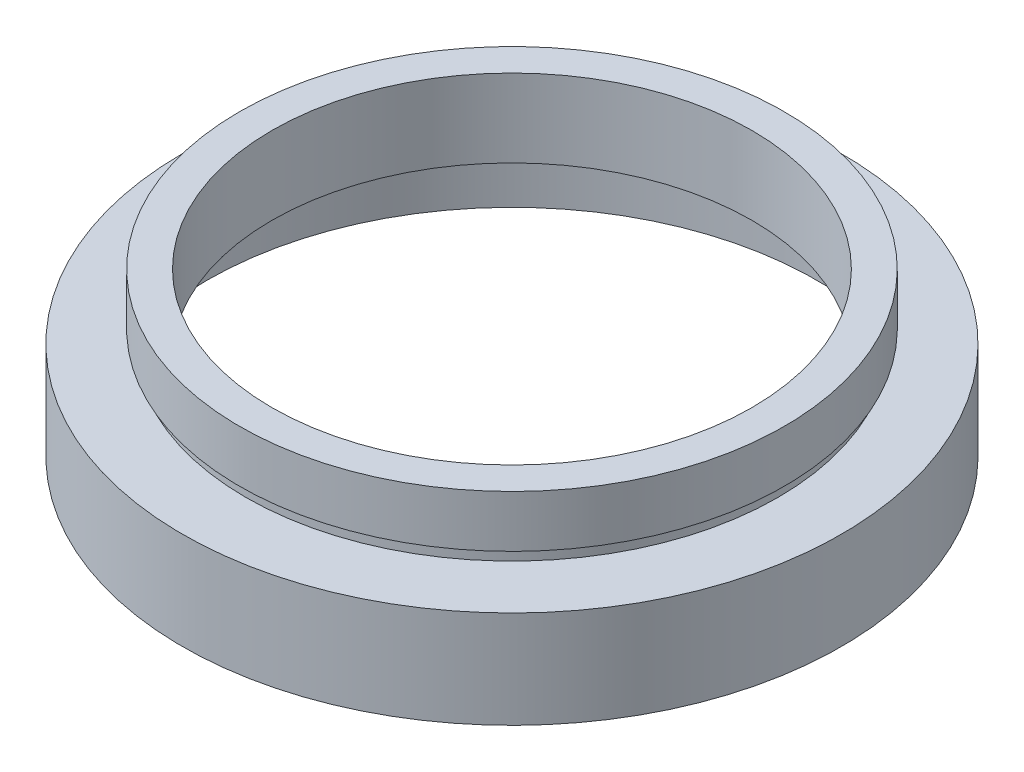
ISO-10303-21;
HEADER;
FILE_DESCRIPTION(('STEP AP214'),'2;1');
FILE_NAME('part.step','',(''),(''),'','','');
FILE_SCHEMA(('AUTOMOTIVE_DESIGN { 1 0 10303 214 1 1 1 1 }'));
ENDSEC;
DATA;
#1=APPLICATION_CONTEXT('core data for automotive mechanical design processes');
#2=APPLICATION_PROTOCOL_DEFINITION('international standard','automotive_design',2000,#1);
#3=PRODUCT_CONTEXT('',#1,'mechanical');
#4=PRODUCT('Part','Part','',(#3));
#5=PRODUCT_RELATED_PRODUCT_CATEGORY('part','',(#4));
#6=PRODUCT_DEFINITION_FORMATION('','',#4);
#7=PRODUCT_DEFINITION_CONTEXT('part definition',#1,'design');
#8=PRODUCT_DEFINITION('design','',#6,#7);
#9=PRODUCT_DEFINITION_SHAPE('','',#8);
#10=(LENGTH_UNIT() NAMED_UNIT(*) SI_UNIT(.MILLI.,.METRE.));
#11=(NAMED_UNIT(*) PLANE_ANGLE_UNIT() SI_UNIT($,.RADIAN.));
#12=(NAMED_UNIT(*) SI_UNIT($,.STERADIAN.) SOLID_ANGLE_UNIT());
#13=UNCERTAINTY_MEASURE_WITH_UNIT(LENGTH_MEASURE(1.E-05),#10,'distance_accuracy_value','');
#14=(GEOMETRIC_REPRESENTATION_CONTEXT(3) GLOBAL_UNCERTAINTY_ASSIGNED_CONTEXT((#13)) GLOBAL_UNIT_ASSIGNED_CONTEXT((#10,
#11,#12)) REPRESENTATION_CONTEXT('',''));
#15=CARTESIAN_POINT('',(0.,0.,0.));
#16=DIRECTION('',(0.,0.,1.));
#17=DIRECTION('',(1.,0.,0.));
#18=AXIS2_PLACEMENT_3D('',#15,#16,#17);
#19=CARTESIAN_POINT('',(25.4,0.,0.));
#20=DIRECTION('',(0.,1.,0.));
#21=DIRECTION('',(-1.,0.,0.));
#22=AXIS2_PLACEMENT_3D('',#19,#20,#21);
#23=PLANE('',#22);
#24=CARTESIAN_POINT('',(0.,0.,0.));
#25=DIRECTION('',(0.,1.,0.));
#26=DIRECTION('',(-1.,0.,0.));
#27=AXIS2_PLACEMENT_3D('',#24,#25,#26);
#28=CIRCLE('',#27,25.4);
#29=CARTESIAN_POINT('',(-25.4,0.,0.));
#30=VERTEX_POINT('',#29);
#31=EDGE_CURVE('E77',#30,#30,#28,.T.);
#32=ORIENTED_EDGE('',*,*,#31,.F.);
#33=EDGE_LOOP('',(#32));
#34=FACE_BOUND('',#33,.T.);
#35=CARTESIAN_POINT('',(0.,0.,0.));
#36=DIRECTION('',(0.,1.,0.));
#37=DIRECTION('',(-1.,0.,0.));
#38=AXIS2_PLACEMENT_3D('',#35,#36,#37);
#39=CIRCLE('',#38,23.5);
#40=CARTESIAN_POINT('',(-23.5,0.,0.));
#41=VERTEX_POINT('',#40);
#42=EDGE_CURVE('E10',#41,#41,#39,.T.);
#43=ORIENTED_EDGE('',*,*,#42,.T.);
#44=EDGE_LOOP('',(#43));
#45=FACE_BOUND('',#44,.T.);
#46=ADVANCED_FACE('F37',(#34,#45),#23,.F.);
#47=CARTESIAN_POINT('',(0.,16.8860182370821,0.));
#48=DIRECTION('',(0.,1.,0.));
#49=DIRECTION('',(-1.,0.,0.));
#50=AXIS2_PLACEMENT_3D('',#47,#48,#49);
#51=CYLINDRICAL_SURFACE('',#50,23.5);
#52=ORIENTED_EDGE('',*,*,#42,.F.);
#53=EDGE_LOOP('',(#52));
#54=FACE_BOUND('',#53,.T.);
#55=CARTESIAN_POINT('',(0.,5.5,0.));
#56=DIRECTION('',(0.,1.,0.));
#57=DIRECTION('',(-1.,0.,0.));
#58=AXIS2_PLACEMENT_3D('',#55,#56,#57);
#59=CIRCLE('',#58,23.5);
#60=CARTESIAN_POINT('',(-23.5,5.49999999999999,0.));
#61=VERTEX_POINT('',#60);
#62=EDGE_CURVE('E43',#61,#61,#59,.T.);
#63=ORIENTED_EDGE('',*,*,#62,.T.);
#64=EDGE_LOOP('',(#63));
#65=FACE_BOUND('',#64,.T.);
#66=ADVANCED_FACE('F84',(#54,#65),#51,.F.);
#67=CARTESIAN_POINT('',(23.5,5.5,0.));
#68=DIRECTION('',(0.,-1.,0.));
#69=DIRECTION('',(1.,0.,0.));
#70=AXIS2_PLACEMENT_3D('',#67,#68,#69);
#71=PLANE('',#70);
#72=ORIENTED_EDGE('',*,*,#62,.F.);
#73=EDGE_LOOP('',(#72));
#74=FACE_BOUND('',#73,.T.);
#75=CARTESIAN_POINT('',(0.,5.49999999999999,0.));
#76=DIRECTION('',(0.,1.,0.));
#77=DIRECTION('',(-1.,0.,0.));
#78=AXIS2_PLACEMENT_3D('',#75,#76,#77);
#79=CIRCLE('',#78,24.1);
#80=CARTESIAN_POINT('',(-24.1,5.49999999999999,0.));
#81=VERTEX_POINT('',#80);
#82=EDGE_CURVE('E47',#81,#81,#79,.T.);
#83=ORIENTED_EDGE('',*,*,#82,.T.);
#84=EDGE_LOOP('',(#83));
#85=FACE_BOUND('',#84,.T.);
#86=ADVANCED_FACE('F88',(#74,#85),#71,.F.);
#87=CARTESIAN_POINT('',(0.,16.8860182370821,0.));
#88=DIRECTION('',(0.,1.,0.));
#89=DIRECTION('',(-1.,0.,0.));
#90=AXIS2_PLACEMENT_3D('',#87,#88,#89);
#91=CYLINDRICAL_SURFACE('',#90,24.1);
#92=ORIENTED_EDGE('',*,*,#82,.F.);
#93=EDGE_LOOP('',(#92));
#94=FACE_BOUND('',#93,.T.);
#95=CARTESIAN_POINT('',(0.,6.5,0.));
#96=DIRECTION('',(0.,1.,0.));
#97=DIRECTION('',(-1.,0.,0.));
#98=AXIS2_PLACEMENT_3D('',#95,#96,#97);
#99=CIRCLE('',#98,24.1);
#100=CARTESIAN_POINT('',(-24.1,6.49999999999999,0.));
#101=VERTEX_POINT('',#100);
#102=EDGE_CURVE('E51',#101,#101,#99,.T.);
#103=ORIENTED_EDGE('',*,*,#102,.T.);
#104=EDGE_LOOP('',(#103));
#105=FACE_BOUND('',#104,.T.);
#106=ADVANCED_FACE('F93',(#94,#105),#91,.F.);
#107=CARTESIAN_POINT('',(18.5,6.5,0.));
#108=DIRECTION('',(0.,1.,0.));
#109=DIRECTION('',(-1.,0.,0.));
#110=AXIS2_PLACEMENT_3D('',#107,#108,#109);
#111=PLANE('',#110);
#112=ORIENTED_EDGE('',*,*,#102,.F.);
#113=EDGE_LOOP('',(#112));
#114=FACE_BOUND('',#113,.T.);
#115=CARTESIAN_POINT('',(0.,6.5,0.));
#116=DIRECTION('',(0.,1.,0.));
#117=DIRECTION('',(-1.,0.,0.));
#118=AXIS2_PLACEMENT_3D('',#115,#116,#117);
#119=CIRCLE('',#118,18.5);
#120=CARTESIAN_POINT('',(-18.5,6.49999999999999,0.));
#121=VERTEX_POINT('',#120);
#122=EDGE_CURVE('E56',#121,#121,#119,.T.);
#123=ORIENTED_EDGE('',*,*,#122,.T.);
#124=EDGE_LOOP('',(#123));
#125=FACE_BOUND('',#124,.T.);
#126=ADVANCED_FACE('F99',(#114,#125),#111,.F.);
#127=CARTESIAN_POINT('',(0.,16.8860182370821,0.));
#128=DIRECTION('',(0.,1.,0.));
#129=DIRECTION('',(-1.,0.,0.));
#130=AXIS2_PLACEMENT_3D('',#127,#128,#129);
#131=CYLINDRICAL_SURFACE('',#130,18.5);
#132=ORIENTED_EDGE('',*,*,#122,.F.);
#133=EDGE_LOOP('',(#132));
#134=FACE_BOUND('',#133,.T.);
#135=CARTESIAN_POINT('',(0.,12.5,0.));
#136=DIRECTION('',(0.,1.,0.));
#137=DIRECTION('',(-1.,0.,0.));
#138=AXIS2_PLACEMENT_3D('',#135,#136,#137);
#139=CIRCLE('',#138,18.5);
#140=CARTESIAN_POINT('',(-18.5,12.5,0.));
#141=VERTEX_POINT('',#140);
#142=EDGE_CURVE('E59',#141,#141,#139,.T.);
#143=ORIENTED_EDGE('',*,*,#142,.T.);
#144=EDGE_LOOP('',(#143));
#145=FACE_BOUND('',#144,.T.);
#146=ADVANCED_FACE('F103',(#134,#145),#131,.F.);
#147=CARTESIAN_POINT('',(18.5,12.5,0.));
#148=DIRECTION('',(0.,-1.,0.));
#149=DIRECTION('',(1.,0.,0.));
#150=AXIS2_PLACEMENT_3D('',#147,#148,#149);
#151=PLANE('',#150);
#152=ORIENTED_EDGE('',*,*,#142,.F.);
#153=EDGE_LOOP('',(#152));
#154=FACE_BOUND('',#153,.T.);
#155=CARTESIAN_POINT('',(0.,12.5,0.));
#156=DIRECTION('',(0.,1.,0.));
#157=DIRECTION('',(-1.,0.,0.));
#158=AXIS2_PLACEMENT_3D('',#155,#156,#157);
#159=CIRCLE('',#158,21.);
#160=CARTESIAN_POINT('',(-21.,12.5,0.));
#161=VERTEX_POINT('',#160);
#162=EDGE_CURVE('E62',#161,#161,#159,.T.);
#163=ORIENTED_EDGE('',*,*,#162,.T.);
#164=EDGE_LOOP('',(#163));
#165=FACE_BOUND('',#164,.T.);
#166=ADVANCED_FACE('F107',(#154,#165),#151,.F.);
#167=CARTESIAN_POINT('',(0.,16.8860182370821,0.));
#168=DIRECTION('',(0.,1.,0.));
#169=DIRECTION('',(-1.,0.,0.));
#170=AXIS2_PLACEMENT_3D('',#167,#168,#169);
#171=CYLINDRICAL_SURFACE('',#170,21.);
#172=ORIENTED_EDGE('',*,*,#162,.F.);
#173=EDGE_LOOP('',(#172));
#174=FACE_BOUND('',#173,.T.);
#175=CARTESIAN_POINT('',(0.,8.5,0.));
#176=DIRECTION('',(0.,1.,0.));
#177=DIRECTION('',(-1.,0.,0.));
#178=AXIS2_PLACEMENT_3D('',#175,#176,#177);
#179=CIRCLE('',#178,21.);
#180=CARTESIAN_POINT('',(-21.,8.5,0.));
#181=VERTEX_POINT('',#180);
#182=EDGE_CURVE('E65',#181,#181,#179,.T.);
#183=ORIENTED_EDGE('',*,*,#182,.T.);
#184=EDGE_LOOP('',(#183));
#185=FACE_BOUND('',#184,.T.);
#186=ADVANCED_FACE('F111',(#174,#185),#171,.T.);
#187=CARTESIAN_POINT('',(21.,8.5,0.));
#188=DIRECTION('',(0.,1.,0.));
#189=DIRECTION('',(-1.,0.,0.));
#190=AXIS2_PLACEMENT_3D('',#187,#188,#189);
#191=PLANE('',#190);
#192=ORIENTED_EDGE('',*,*,#182,.F.);
#193=EDGE_LOOP('',(#192));
#194=FACE_BOUND('',#193,.T.);
#195=CARTESIAN_POINT('',(0.,8.5,0.));
#196=DIRECTION('',(0.,1.,0.));
#197=DIRECTION('',(-1.,0.,0.));
#198=AXIS2_PLACEMENT_3D('',#195,#196,#197);
#199=CIRCLE('',#198,20.5);
#200=CARTESIAN_POINT('',(-20.5,8.5,0.));
#201=VERTEX_POINT('',#200);
#202=EDGE_CURVE('E68',#201,#201,#199,.T.);
#203=ORIENTED_EDGE('',*,*,#202,.T.);
#204=EDGE_LOOP('',(#203));
#205=FACE_BOUND('',#204,.T.);
#206=ADVANCED_FACE('F115',(#194,#205),#191,.F.);
#207=CARTESIAN_POINT('',(0.,16.8860182370821,0.));
#208=DIRECTION('',(0.,1.,0.));
#209=DIRECTION('',(-1.,0.,0.));
#210=AXIS2_PLACEMENT_3D('',#207,#208,#209);
#211=CYLINDRICAL_SURFACE('',#210,20.5);
#212=ORIENTED_EDGE('',*,*,#202,.F.);
#213=EDGE_LOOP('',(#212));
#214=FACE_BOUND('',#213,.T.);
#215=CARTESIAN_POINT('',(0.,7.5,0.));
#216=DIRECTION('',(0.,1.,0.));
#217=DIRECTION('',(-1.,0.,0.));
#218=AXIS2_PLACEMENT_3D('',#215,#216,#217);
#219=CIRCLE('',#218,20.5);
#220=CARTESIAN_POINT('',(-20.5,7.5,0.));
#221=VERTEX_POINT('',#220);
#222=EDGE_CURVE('E71',#221,#221,#219,.T.);
#223=ORIENTED_EDGE('',*,*,#222,.T.);
#224=EDGE_LOOP('',(#223));
#225=FACE_BOUND('',#224,.T.);
#226=ADVANCED_FACE('F119',(#214,#225),#211,.T.);
#227=CARTESIAN_POINT('',(20.5,7.5,0.));
#228=DIRECTION('',(0.,-1.,0.));
#229=DIRECTION('',(1.,0.,0.));
#230=AXIS2_PLACEMENT_3D('',#227,#228,#229);
#231=PLANE('',#230);
#232=ORIENTED_EDGE('',*,*,#222,.F.);
#233=EDGE_LOOP('',(#232));
#234=FACE_BOUND('',#233,.T.);
#235=CARTESIAN_POINT('',(0.,7.5,0.));
#236=DIRECTION('',(0.,1.,0.));
#237=DIRECTION('',(-1.,0.,0.));
#238=AXIS2_PLACEMENT_3D('',#235,#236,#237);
#239=CIRCLE('',#238,25.4);
#240=CARTESIAN_POINT('',(-25.4,7.49999999999999,0.));
#241=VERTEX_POINT('',#240);
#242=EDGE_CURVE('E74',#241,#241,#239,.T.);
#243=ORIENTED_EDGE('',*,*,#242,.T.);
#244=EDGE_LOOP('',(#243));
#245=FACE_BOUND('',#244,.T.);
#246=ADVANCED_FACE('F123',(#234,#245),#231,.F.);
#247=CARTESIAN_POINT('',(0.,16.8860182370821,0.));
#248=DIRECTION('',(0.,1.,0.));
#249=DIRECTION('',(-1.,0.,0.));
#250=AXIS2_PLACEMENT_3D('',#247,#248,#249);
#251=CYLINDRICAL_SURFACE('',#250,25.4);
#252=ORIENTED_EDGE('',*,*,#242,.F.);
#253=EDGE_LOOP('',(#252));
#254=FACE_BOUND('',#253,.T.);
#255=ORIENTED_EDGE('',*,*,#31,.T.);
#256=EDGE_LOOP('',(#255));
#257=FACE_BOUND('',#256,.T.);
#258=ADVANCED_FACE('F81',(#254,#257),#251,.T.);
#259=CLOSED_SHELL('',(#46,#66,#86,#106,#126,#146,#166,#186,#206,#226,#246,#258));
#260=MANIFOLD_SOLID_BREP('B2',#259);
#261=ADVANCED_BREP_SHAPE_REPRESENTATION('',(#18,#260),#14);
#262=SHAPE_DEFINITION_REPRESENTATION(#9,#261);
ENDSEC;
END-ISO-10303-21;
